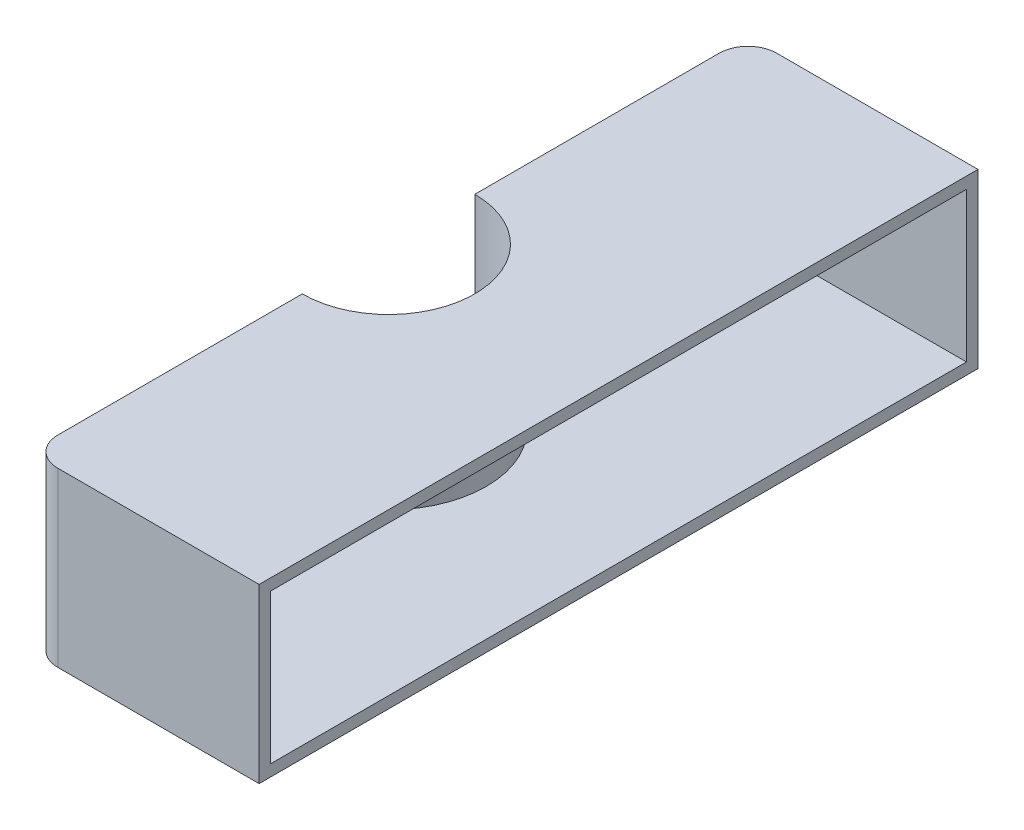
ISO-10303-21;
HEADER;
FILE_DESCRIPTION(('STEP AP214'),'2;1');
FILE_NAME('part.step','',(''),(''),'','','');
FILE_SCHEMA(('AUTOMOTIVE_DESIGN { 1 0 10303 214 1 1 1 1 }'));
ENDSEC;
DATA;
#1=APPLICATION_CONTEXT('core data for automotive mechanical design processes');
#2=APPLICATION_PROTOCOL_DEFINITION('international standard','automotive_design',2000,#1);
#3=PRODUCT_CONTEXT('',#1,'mechanical');
#4=PRODUCT('Part','Part','',(#3));
#5=PRODUCT_RELATED_PRODUCT_CATEGORY('part','',(#4));
#6=PRODUCT_DEFINITION_FORMATION('','',#4);
#7=PRODUCT_DEFINITION_CONTEXT('part definition',#1,'design');
#8=PRODUCT_DEFINITION('design','',#6,#7);
#9=PRODUCT_DEFINITION_SHAPE('','',#8);
#10=(LENGTH_UNIT() NAMED_UNIT(*) SI_UNIT(.MILLI.,.METRE.));
#11=(NAMED_UNIT(*) PLANE_ANGLE_UNIT() SI_UNIT($,.RADIAN.));
#12=(NAMED_UNIT(*) SI_UNIT($,.STERADIAN.) SOLID_ANGLE_UNIT());
#13=UNCERTAINTY_MEASURE_WITH_UNIT(LENGTH_MEASURE(1.E-05),#10,'distance_accuracy_value','');
#14=(GEOMETRIC_REPRESENTATION_CONTEXT(3) GLOBAL_UNCERTAINTY_ASSIGNED_CONTEXT((#13)) GLOBAL_UNIT_ASSIGNED_CONTEXT((#10,
#11,#12)) REPRESENTATION_CONTEXT('',''));
#15=CARTESIAN_POINT('',(0.,0.,0.));
#16=DIRECTION('',(0.,0.,1.));
#17=DIRECTION('',(1.,0.,0.));
#18=AXIS2_PLACEMENT_3D('',#15,#16,#17);
#19=CARTESIAN_POINT('',(-0.95,0.3,0.575));
#20=DIRECTION('',(0.,-1.,0.));
#21=DIRECTION('',(0.,0.,-1.));
#22=AXIS2_PLACEMENT_3D('',#19,#20,#21);
#23=CYLINDRICAL_SURFACE('',#22,0.03);
#24=CARTESIAN_POINT('',(-0.95,0.0200000000000002,0.575));
#25=DIRECTION('',(0.,-1.,0.));
#26=DIRECTION('',(1.,0.,0.));
#27=AXIS2_PLACEMENT_3D('',#24,#25,#26);
#28=CIRCLE('',#27,0.03);
#29=CARTESIAN_POINT('',(-0.95,0.0200000000000002,0.605));
#30=VERTEX_POINT('',#29);
#31=CARTESIAN_POINT('',(-0.98,0.0200000000000002,0.575000000000001));
#32=VERTEX_POINT('',#31);
#33=EDGE_CURVE('E11',#30,#32,#28,.T.);
#34=ORIENTED_EDGE('',*,*,#33,.T.);
#35=DIRECTION('',(0.,-1.,0.));
#36=VECTOR('',#35,1.);
#37=CARTESIAN_POINT('',(-0.98,0.3,0.575000000000001));
#38=LINE('',#37,#36);
#39=CARTESIAN_POINT('',(-0.98,0.28,0.575000000000001));
#40=VERTEX_POINT('',#39);
#41=EDGE_CURVE('E24',#40,#32,#38,.T.);
#42=ORIENTED_EDGE('',*,*,#41,.F.);
#43=CARTESIAN_POINT('',(-0.95,0.28,0.575));
#44=DIRECTION('',(0.,1.,0.));
#45=DIRECTION('',(-1.,0.,0.));
#46=AXIS2_PLACEMENT_3D('',#43,#44,#45);
#47=CIRCLE('',#46,0.03);
#48=CARTESIAN_POINT('',(-0.95,0.28,0.605));
#49=VERTEX_POINT('',#48);
#50=EDGE_CURVE('E256',#40,#49,#47,.T.);
#51=ORIENTED_EDGE('',*,*,#50,.T.);
#52=DIRECTION('',(0.,-1.,0.));
#53=VECTOR('',#52,1.);
#54=CARTESIAN_POINT('',(-0.95,0.3,0.605));
#55=LINE('',#54,#53);
#56=EDGE_CURVE('E36',#49,#30,#55,.T.);
#57=ORIENTED_EDGE('',*,*,#56,.T.);
#58=EDGE_LOOP('',(#34,#42,#51,#57));
#59=FACE_BOUND('',#58,.T.);
#60=ADVANCED_FACE('F17',(#59),#23,.F.);
#61=CARTESIAN_POINT('',(-0.98,0.3,0.168819430161342));
#62=DIRECTION('',(-1.,0.,0.));
#63=DIRECTION('',(0.,0.,1.));
#64=AXIS2_PLACEMENT_3D('',#61,#62,#63);
#65=PLANE('',#64);
#66=DIRECTION('',(0.,0.,-1.));
#67=VECTOR('',#66,1.);
#68=CARTESIAN_POINT('',(-0.98,0.0200000000000002,0.575000000000001));
#69=LINE('',#68,#67);
#70=CARTESIAN_POINT('',(-0.98,0.0200000000000002,0.168819430161342));
#71=VERTEX_POINT('',#70);
#72=EDGE_CURVE('E253',#32,#71,#69,.T.);
#73=ORIENTED_EDGE('',*,*,#72,.T.);
#74=DIRECTION('',(0.,-1.,0.));
#75=VECTOR('',#74,1.);
#76=CARTESIAN_POINT('',(-0.98,0.3,0.168819430161342));
#77=LINE('',#76,#75);
#78=CARTESIAN_POINT('',(-0.98,0.28,0.168819430161342));
#79=VERTEX_POINT('',#78);
#80=EDGE_CURVE('E250',#79,#71,#77,.T.);
#81=ORIENTED_EDGE('',*,*,#80,.F.);
#82=DIRECTION('',(0.,0.,1.));
#83=VECTOR('',#82,1.);
#84=CARTESIAN_POINT('',(-0.98,0.28,0.168819430161342));
#85=LINE('',#84,#83);
#86=EDGE_CURVE('E248',#79,#40,#85,.T.);
#87=ORIENTED_EDGE('',*,*,#86,.T.);
#88=ORIENTED_EDGE('',*,*,#41,.T.);
#89=EDGE_LOOP('',(#73,#81,#87,#88));
#90=FACE_BOUND('',#89,.T.);
#91=ADVANCED_FACE('F275',(#90),#65,.F.);
#92=CARTESIAN_POINT('',(-1.,0.3,0.));
#93=DIRECTION('',(0.,-1.,0.));
#94=DIRECTION('',(0.,0.,-1.));
#95=AXIS2_PLACEMENT_3D('',#92,#93,#94);
#96=CYLINDRICAL_SURFACE('',#95,0.17);
#97=CARTESIAN_POINT('',(-1.,0.0200000000000002,0.));
#98=DIRECTION('',(0.,1.,0.));
#99=DIRECTION('',(1.,0.,0.));
#100=AXIS2_PLACEMENT_3D('',#97,#98,#99);
#101=CIRCLE('',#100,0.17);
#102=CARTESIAN_POINT('',(-0.98,0.0200000000000002,-0.168819430161341));
#103=VERTEX_POINT('',#102);
#104=EDGE_CURVE('E246',#71,#103,#101,.T.);
#105=ORIENTED_EDGE('',*,*,#104,.T.);
#106=DIRECTION('',(0.,-1.,0.));
#107=VECTOR('',#106,1.);
#108=CARTESIAN_POINT('',(-0.98,0.3,-0.168819430161341));
#109=LINE('',#108,#107);
#110=CARTESIAN_POINT('',(-0.98,0.28,-0.168819430161341));
#111=VERTEX_POINT('',#110);
#112=EDGE_CURVE('E243',#111,#103,#109,.T.);
#113=ORIENTED_EDGE('',*,*,#112,.F.);
#114=CARTESIAN_POINT('',(-1.,0.28,0.));
#115=DIRECTION('',(0.,-1.,0.));
#116=DIRECTION('',(-1.,0.,0.));
#117=AXIS2_PLACEMENT_3D('',#114,#115,#116);
#118=CIRCLE('',#117,0.17);
#119=EDGE_CURVE('E240',#111,#79,#118,.T.);
#120=ORIENTED_EDGE('',*,*,#119,.T.);
#121=ORIENTED_EDGE('',*,*,#80,.T.);
#122=EDGE_LOOP('',(#105,#113,#120,#121));
#123=FACE_BOUND('',#122,.T.);
#124=ADVANCED_FACE('F277',(#123),#96,.T.);
#125=CARTESIAN_POINT('',(-0.98,0.3,-0.575));
#126=DIRECTION('',(-1.,0.,0.));
#127=DIRECTION('',(0.,0.,1.));
#128=AXIS2_PLACEMENT_3D('',#125,#126,#127);
#129=PLANE('',#128);
#130=DIRECTION('',(0.,0.,-1.));
#131=VECTOR('',#130,1.);
#132=CARTESIAN_POINT('',(-0.98,0.0200000000000002,-0.168819430161341));
#133=LINE('',#132,#131);
#134=CARTESIAN_POINT('',(-0.98,0.0200000000000002,-0.575));
#135=VERTEX_POINT('',#134);
#136=EDGE_CURVE('E238',#103,#135,#133,.T.);
#137=ORIENTED_EDGE('',*,*,#136,.T.);
#138=DIRECTION('',(0.,-1.,0.));
#139=VECTOR('',#138,1.);
#140=CARTESIAN_POINT('',(-0.98,0.3,-0.575));
#141=LINE('',#140,#139);
#142=CARTESIAN_POINT('',(-0.98,0.28,-0.575));
#143=VERTEX_POINT('',#142);
#144=EDGE_CURVE('E235',#143,#135,#141,.T.);
#145=ORIENTED_EDGE('',*,*,#144,.F.);
#146=DIRECTION('',(0.,0.,1.));
#147=VECTOR('',#146,1.);
#148=CARTESIAN_POINT('',(-0.98,0.28,-0.575));
#149=LINE('',#148,#147);
#150=EDGE_CURVE('E232',#143,#111,#149,.T.);
#151=ORIENTED_EDGE('',*,*,#150,.T.);
#152=ORIENTED_EDGE('',*,*,#112,.T.);
#153=EDGE_LOOP('',(#137,#145,#151,#152));
#154=FACE_BOUND('',#153,.T.);
#155=ADVANCED_FACE('F281',(#154),#129,.F.);
#156=CARTESIAN_POINT('',(-0.95,0.3,-0.575));
#157=DIRECTION('',(0.,-1.,0.));
#158=DIRECTION('',(0.,0.,-1.));
#159=AXIS2_PLACEMENT_3D('',#156,#157,#158);
#160=CYLINDRICAL_SURFACE('',#159,0.03);
#161=CARTESIAN_POINT('',(-0.95,0.0200000000000002,-0.575));
#162=DIRECTION('',(0.,-1.,0.));
#163=DIRECTION('',(1.,0.,0.));
#164=AXIS2_PLACEMENT_3D('',#161,#162,#163);
#165=CIRCLE('',#164,0.03);
#166=CARTESIAN_POINT('',(-0.95,0.0200000000000002,-0.605));
#167=VERTEX_POINT('',#166);
#168=EDGE_CURVE('E229',#135,#167,#165,.T.);
#169=ORIENTED_EDGE('',*,*,#168,.T.);
#170=DIRECTION('',(0.,-1.,0.));
#171=VECTOR('',#170,1.);
#172=CARTESIAN_POINT('',(-0.95,0.3,-0.605));
#173=LINE('',#172,#171);
#174=CARTESIAN_POINT('',(-0.95,0.28,-0.605));
#175=VERTEX_POINT('',#174);
#176=EDGE_CURVE('E227',#175,#167,#173,.T.);
#177=ORIENTED_EDGE('',*,*,#176,.F.);
#178=CARTESIAN_POINT('',(-0.95,0.28,-0.575));
#179=DIRECTION('',(0.,1.,0.));
#180=DIRECTION('',(-1.,0.,0.));
#181=AXIS2_PLACEMENT_3D('',#178,#179,#180);
#182=CIRCLE('',#181,0.03);
#183=EDGE_CURVE('E224',#175,#143,#182,.T.);
#184=ORIENTED_EDGE('',*,*,#183,.T.);
#185=ORIENTED_EDGE('',*,*,#144,.T.);
#186=EDGE_LOOP('',(#169,#177,#184,#185));
#187=FACE_BOUND('',#186,.T.);
#188=ADVANCED_FACE('F283',(#187),#160,.F.);
#189=CARTESIAN_POINT('',(-0.6,0.3,-0.605));
#190=DIRECTION('',(0.,0.,-1.));
#191=DIRECTION('',(-1.,0.,0.));
#192=AXIS2_PLACEMENT_3D('',#189,#190,#191);
#193=PLANE('',#192);
#194=DIRECTION('',(1.,0.,0.));
#195=VECTOR('',#194,1.);
#196=CARTESIAN_POINT('',(-0.95,0.0200000000000002,-0.605));
#197=LINE('',#196,#195);
#198=CARTESIAN_POINT('',(-0.6,0.0200000000000002,-0.605));
#199=VERTEX_POINT('',#198);
#200=EDGE_CURVE('E222',#167,#199,#197,.T.);
#201=ORIENTED_EDGE('',*,*,#200,.T.);
#202=DIRECTION('',(0.,-1.,0.));
#203=VECTOR('',#202,1.);
#204=CARTESIAN_POINT('',(-0.6,0.3,-0.605));
#205=LINE('',#204,#203);
#206=CARTESIAN_POINT('',(-0.6,0.28,-0.605));
#207=VERTEX_POINT('',#206);
#208=EDGE_CURVE('E219',#207,#199,#205,.T.);
#209=ORIENTED_EDGE('',*,*,#208,.F.);
#210=DIRECTION('',(-1.,0.,0.));
#211=VECTOR('',#210,1.);
#212=CARTESIAN_POINT('',(-0.6,0.28,-0.605));
#213=LINE('',#212,#211);
#214=EDGE_CURVE('E216',#207,#175,#213,.T.);
#215=ORIENTED_EDGE('',*,*,#214,.T.);
#216=ORIENTED_EDGE('',*,*,#176,.T.);
#217=EDGE_LOOP('',(#201,#209,#215,#216));
#218=FACE_BOUND('',#217,.T.);
#219=ADVANCED_FACE('F286',(#218),#193,.F.);
#220=CARTESIAN_POINT('',(-0.95,0.3,0.605));
#221=DIRECTION('',(0.,0.,1.));
#222=DIRECTION('',(1.,0.,0.));
#223=AXIS2_PLACEMENT_3D('',#220,#221,#222);
#224=PLANE('',#223);
#225=DIRECTION('',(-1.,0.,0.));
#226=VECTOR('',#225,1.);
#227=CARTESIAN_POINT('',(-0.6,0.0200000000000002,0.605));
#228=LINE('',#227,#226);
#229=CARTESIAN_POINT('',(-0.6,0.0200000000000002,0.605));
#230=VERTEX_POINT('',#229);
#231=EDGE_CURVE('E213',#230,#30,#228,.T.);
#232=ORIENTED_EDGE('',*,*,#231,.T.);
#233=ORIENTED_EDGE('',*,*,#56,.F.);
#234=DIRECTION('',(1.,0.,0.));
#235=VECTOR('',#234,1.);
#236=CARTESIAN_POINT('',(-0.95,0.28,0.605));
#237=LINE('',#236,#235);
#238=CARTESIAN_POINT('',(-0.6,0.28,0.605));
#239=VERTEX_POINT('',#238);
#240=EDGE_CURVE('E211',#49,#239,#237,.T.);
#241=ORIENTED_EDGE('',*,*,#240,.T.);
#242=DIRECTION('',(0.,-1.,0.));
#243=VECTOR('',#242,1.);
#244=CARTESIAN_POINT('',(-0.6,0.3,0.605));
#245=LINE('',#244,#243);
#246=EDGE_CURVE('E208',#239,#230,#245,.T.);
#247=ORIENTED_EDGE('',*,*,#246,.T.);
#248=EDGE_LOOP('',(#232,#233,#241,#247));
#249=FACE_BOUND('',#248,.T.);
#250=ADVANCED_FACE('F265',(#249),#224,.F.);
#251=CARTESIAN_POINT('',(-0.6,0.3,-0.625));
#252=DIRECTION('',(0.,0.,1.));
#253=DIRECTION('',(1.,0.,0.));
#254=AXIS2_PLACEMENT_3D('',#251,#252,#253);
#255=PLANE('',#254);
#256=DIRECTION('',(-1.,0.,0.));
#257=VECTOR('',#256,1.);
#258=CARTESIAN_POINT('',(-0.6,0.,-0.625));
#259=LINE('',#258,#257);
#260=CARTESIAN_POINT('',(-0.6,0.,-0.625));
#261=VERTEX_POINT('',#260);
#262=CARTESIAN_POINT('',(-0.95,0.,-0.625));
#263=VERTEX_POINT('',#262);
#264=EDGE_CURVE('E206',#261,#263,#259,.T.);
#265=ORIENTED_EDGE('',*,*,#264,.T.);
#266=DIRECTION('',(0.,-1.,0.));
#267=VECTOR('',#266,1.);
#268=CARTESIAN_POINT('',(-0.95,0.3,-0.625));
#269=LINE('',#268,#267);
#270=CARTESIAN_POINT('',(-0.95,0.3,-0.625));
#271=VERTEX_POINT('',#270);
#272=EDGE_CURVE('E203',#271,#263,#269,.T.);
#273=ORIENTED_EDGE('',*,*,#272,.F.);
#274=DIRECTION('',(-1.,0.,0.));
#275=VECTOR('',#274,1.);
#276=CARTESIAN_POINT('',(-0.6,0.3,-0.625));
#277=LINE('',#276,#275);
#278=CARTESIAN_POINT('',(-0.6,0.3,-0.625));
#279=VERTEX_POINT('',#278);
#280=EDGE_CURVE('E201',#279,#271,#277,.T.);
#281=ORIENTED_EDGE('',*,*,#280,.F.);
#282=DIRECTION('',(0.,-1.,0.));
#283=VECTOR('',#282,1.);
#284=CARTESIAN_POINT('',(-0.6,0.3,-0.625));
#285=LINE('',#284,#283);
#286=EDGE_CURVE('E154',#279,#261,#285,.T.);
#287=ORIENTED_EDGE('',*,*,#286,.T.);
#288=EDGE_LOOP('',(#265,#273,#281,#287));
#289=FACE_BOUND('',#288,.T.);
#290=ADVANCED_FACE('F294',(#289),#255,.F.);
#291=CARTESIAN_POINT('',(-0.95,0.3,-0.575));
#292=DIRECTION('',(0.,-1.,0.));
#293=DIRECTION('',(0.,0.,-1.));
#294=AXIS2_PLACEMENT_3D('',#291,#292,#293);
#295=CYLINDRICAL_SURFACE('',#294,0.05);
#296=CARTESIAN_POINT('',(-0.95,0.,-0.575));
#297=DIRECTION('',(0.,1.,0.));
#298=DIRECTION('',(0.,0.,1.));
#299=AXIS2_PLACEMENT_3D('',#296,#297,#298);
#300=CIRCLE('',#299,0.05);
#301=CARTESIAN_POINT('',(-1.,0.,-0.575));
#302=VERTEX_POINT('',#301);
#303=EDGE_CURVE('E198',#263,#302,#300,.T.);
#304=ORIENTED_EDGE('',*,*,#303,.T.);
#305=DIRECTION('',(0.,-1.,0.));
#306=VECTOR('',#305,1.);
#307=CARTESIAN_POINT('',(-1.,0.3,-0.575));
#308=LINE('',#307,#306);
#309=CARTESIAN_POINT('',(-1.,0.3,-0.575));
#310=VERTEX_POINT('',#309);
#311=EDGE_CURVE('E195',#310,#302,#308,.T.);
#312=ORIENTED_EDGE('',*,*,#311,.F.);
#313=CARTESIAN_POINT('',(-0.95,0.3,-0.575));
#314=DIRECTION('',(0.,1.,0.));
#315=DIRECTION('',(0.,0.,1.));
#316=AXIS2_PLACEMENT_3D('',#313,#314,#315);
#317=CIRCLE('',#316,0.05);
#318=EDGE_CURVE('E192',#271,#310,#317,.T.);
#319=ORIENTED_EDGE('',*,*,#318,.F.);
#320=ORIENTED_EDGE('',*,*,#272,.T.);
#321=EDGE_LOOP('',(#304,#312,#319,#320));
#322=FACE_BOUND('',#321,.T.);
#323=ADVANCED_FACE('F339',(#322),#295,.T.);
#324=CARTESIAN_POINT('',(-1.,0.3,-0.575));
#325=DIRECTION('',(1.,0.,0.));
#326=DIRECTION('',(0.,0.,-1.));
#327=AXIS2_PLACEMENT_3D('',#324,#325,#326);
#328=PLANE('',#327);
#329=DIRECTION('',(0.,0.,1.));
#330=VECTOR('',#329,1.);
#331=CARTESIAN_POINT('',(-1.,0.,-0.575));
#332=LINE('',#331,#330);
#333=CARTESIAN_POINT('',(-1.,0.,-0.15));
#334=VERTEX_POINT('',#333);
#335=EDGE_CURVE('E190',#302,#334,#332,.T.);
#336=ORIENTED_EDGE('',*,*,#335,.T.);
#337=DIRECTION('',(0.,-1.,0.));
#338=VECTOR('',#337,1.);
#339=CARTESIAN_POINT('',(-1.,0.3,-0.15));
#340=LINE('',#339,#338);
#341=CARTESIAN_POINT('',(-1.,0.3,-0.15));
#342=VERTEX_POINT('',#341);
#343=EDGE_CURVE('E187',#342,#334,#340,.T.);
#344=ORIENTED_EDGE('',*,*,#343,.F.);
#345=DIRECTION('',(0.,0.,1.));
#346=VECTOR('',#345,1.);
#347=CARTESIAN_POINT('',(-1.,0.3,-0.575));
#348=LINE('',#347,#346);
#349=EDGE_CURVE('E184',#310,#342,#348,.T.);
#350=ORIENTED_EDGE('',*,*,#349,.F.);
#351=ORIENTED_EDGE('',*,*,#311,.T.);
#352=EDGE_LOOP('',(#336,#344,#350,#351));
#353=FACE_BOUND('',#352,.T.);
#354=ADVANCED_FACE('F349',(#353),#328,.F.);
#355=CARTESIAN_POINT('',(-1.,0.3,0.));
#356=DIRECTION('',(0.,-1.,0.));
#357=DIRECTION('',(0.,0.,-1.));
#358=AXIS2_PLACEMENT_3D('',#355,#356,#357);
#359=CYLINDRICAL_SURFACE('',#358,0.15);
#360=CARTESIAN_POINT('',(-1.,0.,0.));
#361=DIRECTION('',(0.,-1.,0.));
#362=DIRECTION('',(0.,0.,1.));
#363=AXIS2_PLACEMENT_3D('',#360,#361,#362);
#364=CIRCLE('',#363,0.15);
#365=CARTESIAN_POINT('',(-1.,0.,0.15));
#366=VERTEX_POINT('',#365);
#367=EDGE_CURVE('E181',#334,#366,#364,.T.);
#368=ORIENTED_EDGE('',*,*,#367,.T.);
#369=DIRECTION('',(0.,-1.,0.));
#370=VECTOR('',#369,1.);
#371=CARTESIAN_POINT('',(-1.,0.3,0.15));
#372=LINE('',#371,#370);
#373=CARTESIAN_POINT('',(-1.,0.3,0.15));
#374=VERTEX_POINT('',#373);
#375=EDGE_CURVE('E179',#374,#366,#372,.T.);
#376=ORIENTED_EDGE('',*,*,#375,.F.);
#377=CARTESIAN_POINT('',(-1.,0.3,0.));
#378=DIRECTION('',(0.,-1.,0.));
#379=DIRECTION('',(0.,0.,1.));
#380=AXIS2_PLACEMENT_3D('',#377,#378,#379);
#381=CIRCLE('',#380,0.15);
#382=EDGE_CURVE('E177',#342,#374,#381,.T.);
#383=ORIENTED_EDGE('',*,*,#382,.F.);
#384=ORIENTED_EDGE('',*,*,#343,.T.);
#385=EDGE_LOOP('',(#368,#376,#383,#384));
#386=FACE_BOUND('',#385,.T.);
#387=ADVANCED_FACE('F359',(#386),#359,.F.);
#388=CARTESIAN_POINT('',(-1.,0.3,0.15));
#389=DIRECTION('',(1.,0.,0.));
#390=DIRECTION('',(0.,0.,-1.));
#391=AXIS2_PLACEMENT_3D('',#388,#389,#390);
#392=PLANE('',#391);
#393=DIRECTION('',(0.,0.,1.));
#394=VECTOR('',#393,1.);
#395=CARTESIAN_POINT('',(-1.,0.,0.15));
#396=LINE('',#395,#394);
#397=CARTESIAN_POINT('',(-1.,0.,0.575000000000001));
#398=VERTEX_POINT('',#397);
#399=EDGE_CURVE('E175',#366,#398,#396,.T.);
#400=ORIENTED_EDGE('',*,*,#399,.T.);
#401=DIRECTION('',(0.,-1.,0.));
#402=VECTOR('',#401,1.);
#403=CARTESIAN_POINT('',(-1.,0.3,0.575000000000001));
#404=LINE('',#403,#402);
#405=CARTESIAN_POINT('',(-1.,0.3,0.575000000000001));
#406=VERTEX_POINT('',#405);
#407=EDGE_CURVE('E172',#406,#398,#404,.T.);
#408=ORIENTED_EDGE('',*,*,#407,.F.);
#409=DIRECTION('',(0.,0.,1.));
#410=VECTOR('',#409,1.);
#411=CARTESIAN_POINT('',(-1.,0.3,0.15));
#412=LINE('',#411,#410);
#413=EDGE_CURVE('E170',#374,#406,#412,.T.);
#414=ORIENTED_EDGE('',*,*,#413,.F.);
#415=ORIENTED_EDGE('',*,*,#375,.T.);
#416=EDGE_LOOP('',(#400,#408,#414,#415));
#417=FACE_BOUND('',#416,.T.);
#418=ADVANCED_FACE('F369',(#417),#392,.F.);
#419=CARTESIAN_POINT('',(-0.95,0.3,0.575));
#420=DIRECTION('',(0.,-1.,0.));
#421=DIRECTION('',(0.,0.,-1.));
#422=AXIS2_PLACEMENT_3D('',#419,#420,#421);
#423=CYLINDRICAL_SURFACE('',#422,0.05);
#424=CARTESIAN_POINT('',(-0.95,0.,0.575));
#425=DIRECTION('',(0.,1.,0.));
#426=DIRECTION('',(0.,0.,1.));
#427=AXIS2_PLACEMENT_3D('',#424,#425,#426);
#428=CIRCLE('',#427,0.05);
#429=CARTESIAN_POINT('',(-0.95,0.,0.625));
#430=VERTEX_POINT('',#429);
#431=EDGE_CURVE('E168',#398,#430,#428,.T.);
#432=ORIENTED_EDGE('',*,*,#431,.T.);
#433=DIRECTION('',(0.,-1.,0.));
#434=VECTOR('',#433,1.);
#435=CARTESIAN_POINT('',(-0.95,0.3,0.625));
#436=LINE('',#435,#434);
#437=CARTESIAN_POINT('',(-0.95,0.3,0.625));
#438=VERTEX_POINT('',#437);
#439=EDGE_CURVE('E166',#438,#430,#436,.T.);
#440=ORIENTED_EDGE('',*,*,#439,.F.);
#441=CARTESIAN_POINT('',(-0.95,0.3,0.575));
#442=DIRECTION('',(0.,1.,0.));
#443=DIRECTION('',(0.,0.,1.));
#444=AXIS2_PLACEMENT_3D('',#441,#442,#443);
#445=CIRCLE('',#444,0.05);
#446=EDGE_CURVE('E148',#406,#438,#445,.T.);
#447=ORIENTED_EDGE('',*,*,#446,.F.);
#448=ORIENTED_EDGE('',*,*,#407,.T.);
#449=EDGE_LOOP('',(#432,#440,#447,#448));
#450=FACE_BOUND('',#449,.T.);
#451=ADVANCED_FACE('F379',(#450),#423,.T.);
#452=CARTESIAN_POINT('',(-0.95,0.3,0.625));
#453=DIRECTION('',(0.,0.,-1.));
#454=DIRECTION('',(-1.,0.,0.));
#455=AXIS2_PLACEMENT_3D('',#452,#453,#454);
#456=PLANE('',#455);
#457=DIRECTION('',(1.,0.,0.));
#458=VECTOR('',#457,1.);
#459=CARTESIAN_POINT('',(-0.95,0.,0.625));
#460=LINE('',#459,#458);
#461=CARTESIAN_POINT('',(-0.6,0.,0.625));
#462=VERTEX_POINT('',#461);
#463=EDGE_CURVE('E134',#430,#462,#460,.T.);
#464=ORIENTED_EDGE('',*,*,#463,.T.);
#465=DIRECTION('',(0.,-1.,0.));
#466=VECTOR('',#465,1.);
#467=CARTESIAN_POINT('',(-0.6,0.3,0.625));
#468=LINE('',#467,#466);
#469=CARTESIAN_POINT('',(-0.6,0.3,0.625));
#470=VERTEX_POINT('',#469);
#471=EDGE_CURVE('E128',#470,#462,#468,.T.);
#472=ORIENTED_EDGE('',*,*,#471,.F.);
#473=DIRECTION('',(1.,0.,0.));
#474=VECTOR('',#473,1.);
#475=CARTESIAN_POINT('',(-0.95,0.3,0.625));
#476=LINE('',#475,#474);
#477=EDGE_CURVE('E132',#438,#470,#476,.T.);
#478=ORIENTED_EDGE('',*,*,#477,.F.);
#479=ORIENTED_EDGE('',*,*,#439,.T.);
#480=EDGE_LOOP('',(#464,#472,#478,#479));
#481=FACE_BOUND('',#480,.T.);
#482=ADVANCED_FACE('F130',(#481),#456,.F.);
#483=CARTESIAN_POINT('',(-0.6,0.3,0.605));
#484=DIRECTION('',(-1.,0.,0.));
#485=DIRECTION('',(0.,0.,1.));
#486=AXIS2_PLACEMENT_3D('',#483,#484,#485);
#487=PLANE('',#486);
#488=DIRECTION('',(0.,0.,1.));
#489=VECTOR('',#488,1.);
#490=CARTESIAN_POINT('',(-0.6,0.0200000000000002,-0.605));
#491=LINE('',#490,#489);
#492=EDGE_CURVE('E149',#199,#230,#491,.T.);
#493=ORIENTED_EDGE('',*,*,#492,.T.);
#494=ORIENTED_EDGE('',*,*,#246,.F.);
#495=DIRECTION('',(0.,0.,-1.));
#496=VECTOR('',#495,1.);
#497=CARTESIAN_POINT('',(-0.6,0.28,0.605));
#498=LINE('',#497,#496);
#499=EDGE_CURVE('E157',#239,#207,#498,.T.);
#500=ORIENTED_EDGE('',*,*,#499,.T.);
#501=ORIENTED_EDGE('',*,*,#208,.T.);
#502=EDGE_LOOP('',(#493,#494,#500,#501));
#503=FACE_BOUND('',#502,.T.);
#504=DIRECTION('',(0.,0.,-1.));
#505=VECTOR('',#504,1.);
#506=CARTESIAN_POINT('',(-0.6,0.,0.605));
#507=LINE('',#506,#505);
#508=EDGE_CURVE('E155',#462,#261,#507,.T.);
#509=ORIENTED_EDGE('',*,*,#508,.T.);
#510=ORIENTED_EDGE('',*,*,#286,.F.);
#511=DIRECTION('',(0.,0.,-1.));
#512=VECTOR('',#511,1.);
#513=CARTESIAN_POINT('',(-0.6,0.3,-0.625));
#514=LINE('',#513,#512);
#515=EDGE_CURVE('E145',#470,#279,#514,.T.);
#516=ORIENTED_EDGE('',*,*,#515,.F.);
#517=ORIENTED_EDGE('',*,*,#471,.T.);
#518=EDGE_LOOP('',(#509,#510,#516,#517));
#519=FACE_BOUND('',#518,.T.);
#520=ADVANCED_FACE('F152',(#503,#519),#487,.F.);
#521=CARTESIAN_POINT('',(-0.95,0.3,0.575));
#522=DIRECTION('',(0.,1.,0.));
#523=DIRECTION('',(0.,0.,1.));
#524=AXIS2_PLACEMENT_3D('',#521,#522,#523);
#525=PLANE('',#524);
#526=ORIENTED_EDGE('',*,*,#477,.T.);
#527=ORIENTED_EDGE('',*,*,#515,.T.);
#528=ORIENTED_EDGE('',*,*,#280,.T.);
#529=ORIENTED_EDGE('',*,*,#318,.T.);
#530=ORIENTED_EDGE('',*,*,#349,.T.);
#531=ORIENTED_EDGE('',*,*,#382,.T.);
#532=ORIENTED_EDGE('',*,*,#413,.T.);
#533=ORIENTED_EDGE('',*,*,#446,.T.);
#534=EDGE_LOOP('',(#526,#527,#528,#529,#530,#531,#532,#533));
#535=FACE_BOUND('',#534,.T.);
#536=ADVANCED_FACE('F143',(#535),#525,.T.);
#537=CARTESIAN_POINT('',(-0.95,0.,0.575));
#538=DIRECTION('',(0.,1.,0.));
#539=DIRECTION('',(0.,0.,1.));
#540=AXIS2_PLACEMENT_3D('',#537,#538,#539);
#541=PLANE('',#540);
#542=ORIENTED_EDGE('',*,*,#264,.F.);
#543=ORIENTED_EDGE('',*,*,#508,.F.);
#544=ORIENTED_EDGE('',*,*,#463,.F.);
#545=ORIENTED_EDGE('',*,*,#431,.F.);
#546=ORIENTED_EDGE('',*,*,#399,.F.);
#547=ORIENTED_EDGE('',*,*,#367,.F.);
#548=ORIENTED_EDGE('',*,*,#335,.F.);
#549=ORIENTED_EDGE('',*,*,#303,.F.);
#550=EDGE_LOOP('',(#542,#543,#544,#545,#546,#547,#548,#549));
#551=FACE_BOUND('',#550,.T.);
#552=ADVANCED_FACE('F414',(#551),#541,.F.);
#553=CARTESIAN_POINT('',(-0.95,0.28,0.575));
#554=DIRECTION('',(0.,1.,0.));
#555=DIRECTION('',(-1.,0.,0.));
#556=AXIS2_PLACEMENT_3D('',#553,#554,#555);
#557=PLANE('',#556);
#558=ORIENTED_EDGE('',*,*,#50,.F.);
#559=ORIENTED_EDGE('',*,*,#86,.F.);
#560=ORIENTED_EDGE('',*,*,#119,.F.);
#561=ORIENTED_EDGE('',*,*,#150,.F.);
#562=ORIENTED_EDGE('',*,*,#183,.F.);
#563=ORIENTED_EDGE('',*,*,#214,.F.);
#564=ORIENTED_EDGE('',*,*,#499,.F.);
#565=ORIENTED_EDGE('',*,*,#240,.F.);
#566=EDGE_LOOP('',(#558,#559,#560,#561,#562,#563,#564,#565));
#567=FACE_BOUND('',#566,.T.);
#568=ADVANCED_FACE('F261',(#567),#557,.F.);
#569=CARTESIAN_POINT('',(-0.95,0.0200000000000002,0.575));
#570=DIRECTION('',(0.,-1.,0.));
#571=DIRECTION('',(1.,0.,0.));
#572=AXIS2_PLACEMENT_3D('',#569,#570,#571);
#573=PLANE('',#572);
#574=ORIENTED_EDGE('',*,*,#492,.F.);
#575=ORIENTED_EDGE('',*,*,#200,.F.);
#576=ORIENTED_EDGE('',*,*,#168,.F.);
#577=ORIENTED_EDGE('',*,*,#136,.F.);
#578=ORIENTED_EDGE('',*,*,#104,.F.);
#579=ORIENTED_EDGE('',*,*,#72,.F.);
#580=ORIENTED_EDGE('',*,*,#33,.F.);
#581=ORIENTED_EDGE('',*,*,#231,.F.);
#582=EDGE_LOOP('',(#574,#575,#576,#577,#578,#579,#580,#581));
#583=FACE_BOUND('',#582,.T.);
#584=ADVANCED_FACE('F270',(#583),#573,.F.);
#585=CLOSED_SHELL('',(#60,#91,#124,#155,#188,#219,#250,#290,#323,#354,#387,#418,#451,#482,#520,
#536,#552,#568,#584));
#586=MANIFOLD_SOLID_BREP('B1',#585);
#587=ADVANCED_BREP_SHAPE_REPRESENTATION('',(#18,#586),#14);
#588=SHAPE_DEFINITION_REPRESENTATION(#9,#587);
ENDSEC;
END-ISO-10303-21;
